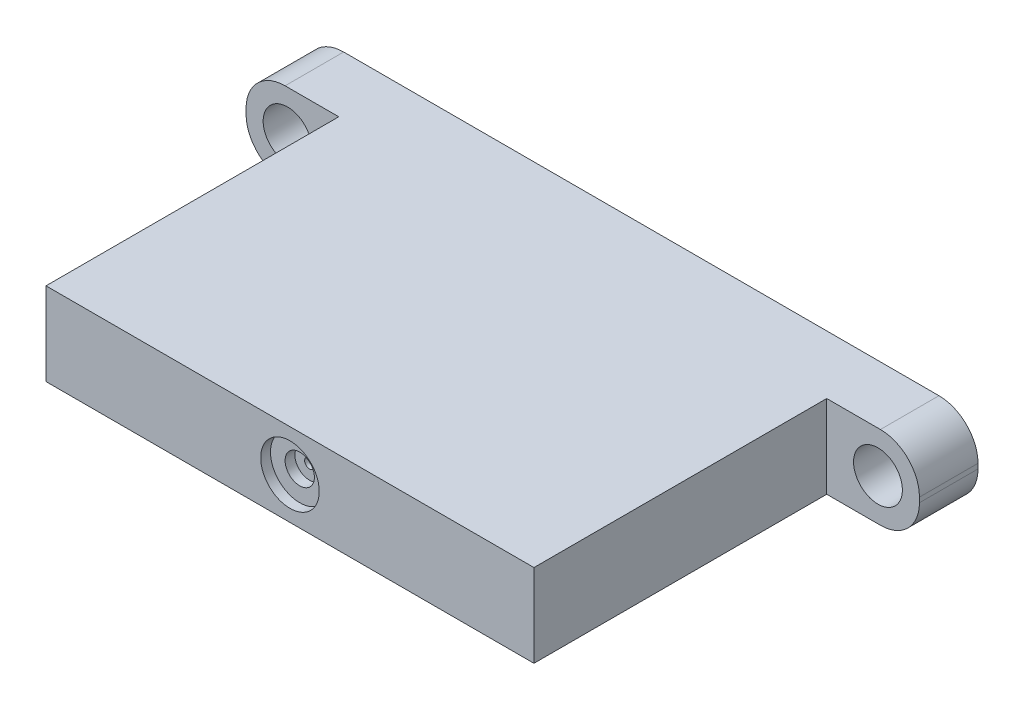
ISO-10303-21;
HEADER;
FILE_DESCRIPTION(('STEP AP214'),'2;1');
FILE_NAME('part.step','',(''),(''),'','','');
FILE_SCHEMA(('AUTOMOTIVE_DESIGN { 1 0 10303 214 1 1 1 1 }'));
ENDSEC;
DATA;
#1=APPLICATION_CONTEXT('core data for automotive mechanical design processes');
#2=APPLICATION_PROTOCOL_DEFINITION('international standard','automotive_design',2000,#1);
#3=PRODUCT_CONTEXT('',#1,'mechanical');
#4=PRODUCT('Part','Part','',(#3));
#5=PRODUCT_RELATED_PRODUCT_CATEGORY('part','',(#4));
#6=PRODUCT_DEFINITION_FORMATION('','',#4);
#7=PRODUCT_DEFINITION_CONTEXT('part definition',#1,'design');
#8=PRODUCT_DEFINITION('design','',#6,#7);
#9=PRODUCT_DEFINITION_SHAPE('','',#8);
#10=(LENGTH_UNIT() NAMED_UNIT(*) SI_UNIT(.MILLI.,.METRE.));
#11=(NAMED_UNIT(*) PLANE_ANGLE_UNIT() SI_UNIT($,.RADIAN.));
#12=(NAMED_UNIT(*) SI_UNIT($,.STERADIAN.) SOLID_ANGLE_UNIT());
#13=UNCERTAINTY_MEASURE_WITH_UNIT(LENGTH_MEASURE(1.E-05),#10,'distance_accuracy_value','');
#14=(GEOMETRIC_REPRESENTATION_CONTEXT(3) GLOBAL_UNCERTAINTY_ASSIGNED_CONTEXT((#13)) GLOBAL_UNIT_ASSIGNED_CONTEXT((#10,
#11,#12)) REPRESENTATION_CONTEXT('',''));
#15=CARTESIAN_POINT('',(0.,0.,0.));
#16=DIRECTION('',(0.,0.,1.));
#17=DIRECTION('',(1.,0.,0.));
#18=AXIS2_PLACEMENT_3D('',#15,#16,#17);
#19=CARTESIAN_POINT('',(0.,0.,6.));
#20=DIRECTION('',(0.,0.,1.));
#21=DIRECTION('',(1.,0.,0.));
#22=AXIS2_PLACEMENT_3D('',#19,#20,#21);
#23=PLANE('',#22);
#24=CARTESIAN_POINT('',(-30.25,0.,6.));
#25=DIRECTION('',(0.,0.,1.));
#26=DIRECTION('',(1.,0.,0.));
#27=AXIS2_PLACEMENT_3D('',#24,#25,#26);
#28=CIRCLE('',#27,2.5);
#29=CARTESIAN_POINT('',(-27.75,0.,6.));
#30=VERTEX_POINT('',#29);
#31=EDGE_CURVE('E241',#30,#30,#28,.T.);
#32=ORIENTED_EDGE('',*,*,#31,.F.);
#33=EDGE_LOOP('',(#32));
#34=FACE_BOUND('',#33,.T.);
#35=DIRECTION('',(0.,-1.,0.));
#36=VECTOR('',#35,1.);
#37=CARTESIAN_POINT('',(-34.5,-4.25,6.));
#38=LINE('',#37,#36);
#39=CARTESIAN_POINT('',(-34.5,0.249999999999997,6.));
#40=VERTEX_POINT('',#39);
#41=CARTESIAN_POINT('',(-34.5,-0.250000000000004,6.));
#42=VERTEX_POINT('',#41);
#43=EDGE_CURVE('E158',#40,#42,#38,.T.);
#44=ORIENTED_EDGE('',*,*,#43,.T.);
#45=CARTESIAN_POINT('',(-30.5,-0.250000000000003,6.));
#46=DIRECTION('',(0.,0.,1.));
#47=DIRECTION('',(1.,0.,0.));
#48=AXIS2_PLACEMENT_3D('',#45,#46,#47);
#49=CIRCLE('',#48,4.);
#50=CARTESIAN_POINT('',(-30.5,-4.25,6.));
#51=VERTEX_POINT('',#50);
#52=EDGE_CURVE('E11',#42,#51,#49,.T.);
#53=ORIENTED_EDGE('',*,*,#52,.T.);
#54=DIRECTION('',(1.,0.,0.));
#55=VECTOR('',#54,1.);
#56=CARTESIAN_POINT('',(34.5,-4.25,6.));
#57=LINE('',#56,#55);
#58=CARTESIAN_POINT('',(-25.,-4.25,6.));
#59=VERTEX_POINT('',#58);
#60=EDGE_CURVE('E162',#51,#59,#57,.T.);
#61=ORIENTED_EDGE('',*,*,#60,.T.);
#62=DIRECTION('',(0.,-1.,0.));
#63=VECTOR('',#62,1.);
#64=CARTESIAN_POINT('',(-25.,-4.25,6.));
#65=LINE('',#64,#63);
#66=CARTESIAN_POINT('',(-25.,4.25,6.));
#67=VERTEX_POINT('',#66);
#68=EDGE_CURVE('E149',#67,#59,#65,.T.);
#69=ORIENTED_EDGE('',*,*,#68,.F.);
#70=DIRECTION('',(-1.,0.,0.));
#71=VECTOR('',#70,1.);
#72=CARTESIAN_POINT('',(34.5,4.25,6.));
#73=LINE('',#72,#71);
#74=CARTESIAN_POINT('',(-30.5,4.25,6.));
#75=VERTEX_POINT('',#74);
#76=EDGE_CURVE('E167',#67,#75,#73,.T.);
#77=ORIENTED_EDGE('',*,*,#76,.T.);
#78=CARTESIAN_POINT('',(-30.5,0.249999999999997,6.));
#79=DIRECTION('',(0.,0.,1.));
#80=DIRECTION('',(1.,0.,0.));
#81=AXIS2_PLACEMENT_3D('',#78,#79,#80);
#82=CIRCLE('',#81,4.);
#83=EDGE_CURVE('E42',#75,#40,#82,.T.);
#84=ORIENTED_EDGE('',*,*,#83,.T.);
#85=EDGE_LOOP('',(#44,#53,#61,#69,#77,#84));
#86=FACE_BOUND('',#85,.T.);
#87=ADVANCED_FACE('F34',(#34,#86),#23,.T.);
#88=CARTESIAN_POINT('',(-34.5,-4.25,6.));
#89=DIRECTION('',(1.,0.,0.));
#90=DIRECTION('',(0.,0.,-1.));
#91=AXIS2_PLACEMENT_3D('',#88,#89,#90);
#92=PLANE('',#91);
#93=DIRECTION('',(0.,-1.,0.));
#94=VECTOR('',#93,1.);
#95=CARTESIAN_POINT('',(-34.5,-4.25,0.));
#96=LINE('',#95,#94);
#97=CARTESIAN_POINT('',(-34.5,0.249999999999997,0.));
#98=VERTEX_POINT('',#97);
#99=CARTESIAN_POINT('',(-34.5,-0.250000000000004,0.));
#100=VERTEX_POINT('',#99);
#101=EDGE_CURVE('E150',#98,#100,#96,.T.);
#102=ORIENTED_EDGE('',*,*,#101,.T.);
#103=DIRECTION('',(0.,0.,-1.));
#104=VECTOR('',#103,1.);
#105=CARTESIAN_POINT('',(-34.5,-0.250000000000004,6.));
#106=LINE('',#105,#104);
#107=EDGE_CURVE('E49',#100,#42,#106,.F.);
#108=ORIENTED_EDGE('',*,*,#107,.T.);
#109=ORIENTED_EDGE('',*,*,#43,.F.);
#110=DIRECTION('',(0.,0.,-1.));
#111=VECTOR('',#110,1.);
#112=CARTESIAN_POINT('',(-34.5,0.249999999999997,6.));
#113=LINE('',#112,#111);
#114=EDGE_CURVE('E203',#40,#98,#113,.T.);
#115=ORIENTED_EDGE('',*,*,#114,.T.);
#116=EDGE_LOOP('',(#102,#108,#109,#115));
#117=FACE_BOUND('',#116,.T.);
#118=ADVANCED_FACE('F208',(#117),#92,.F.);
#119=CARTESIAN_POINT('',(34.5,-4.25,6.));
#120=DIRECTION('',(0.,1.,0.));
#121=DIRECTION('',(-1.,0.,0.));
#122=AXIS2_PLACEMENT_3D('',#119,#120,#121);
#123=PLANE('',#122);
#124=DIRECTION('',(1.,0.,0.));
#125=VECTOR('',#124,1.);
#126=CARTESIAN_POINT('',(34.5,-4.25,0.));
#127=LINE('',#126,#125);
#128=CARTESIAN_POINT('',(-30.5,-4.25,0.));
#129=VERTEX_POINT('',#128);
#130=CARTESIAN_POINT('',(30.5,-4.25,0.));
#131=VERTEX_POINT('',#130);
#132=EDGE_CURVE('E152',#129,#131,#127,.T.);
#133=ORIENTED_EDGE('',*,*,#132,.T.);
#134=DIRECTION('',(0.,0.,-1.));
#135=VECTOR('',#134,1.);
#136=CARTESIAN_POINT('',(30.5,-4.25,6.));
#137=LINE('',#136,#135);
#138=CARTESIAN_POINT('',(30.5,-4.25,6.));
#139=VERTEX_POINT('',#138);
#140=EDGE_CURVE('E201',#131,#139,#137,.F.);
#141=ORIENTED_EDGE('',*,*,#140,.T.);
#142=CARTESIAN_POINT('',(25.,-4.25,6.));
#143=VERTEX_POINT('',#142);
#144=EDGE_CURVE('E160',#143,#139,#57,.T.);
#145=ORIENTED_EDGE('',*,*,#144,.F.);
#146=DIRECTION('',(0.,0.,-1.));
#147=VECTOR('',#146,1.);
#148=CARTESIAN_POINT('',(25.,-4.25,36.));
#149=LINE('',#148,#147);
#150=CARTESIAN_POINT('',(25.,-4.25,36.));
#151=VERTEX_POINT('',#150);
#152=EDGE_CURVE('E133',#151,#143,#149,.T.);
#153=ORIENTED_EDGE('',*,*,#152,.F.);
#154=DIRECTION('',(1.,0.,0.));
#155=VECTOR('',#154,1.);
#156=CARTESIAN_POINT('',(25.,-4.25,36.));
#157=LINE('',#156,#155);
#158=CARTESIAN_POINT('',(-25.,-4.25,36.));
#159=VERTEX_POINT('',#158);
#160=EDGE_CURVE('E123',#159,#151,#157,.T.);
#161=ORIENTED_EDGE('',*,*,#160,.F.);
#162=DIRECTION('',(0.,0.,-1.));
#163=VECTOR('',#162,1.);
#164=CARTESIAN_POINT('',(-25.,-4.25,36.));
#165=LINE('',#164,#163);
#166=EDGE_CURVE('E129',#159,#59,#165,.T.);
#167=ORIENTED_EDGE('',*,*,#166,.T.);
#168=ORIENTED_EDGE('',*,*,#60,.F.);
#169=DIRECTION('',(0.,0.,-1.));
#170=VECTOR('',#169,1.);
#171=CARTESIAN_POINT('',(-30.5,-4.25,6.));
#172=LINE('',#171,#170);
#173=EDGE_CURVE('E198',#51,#129,#172,.T.);
#174=ORIENTED_EDGE('',*,*,#173,.T.);
#175=EDGE_LOOP('',(#133,#141,#145,#153,#161,#167,#168,#174));
#176=FACE_BOUND('',#175,.T.);
#177=ADVANCED_FACE('F126',(#176),#123,.F.);
#178=CARTESIAN_POINT('',(34.5,-4.25,6.));
#179=DIRECTION('',(-1.,0.,0.));
#180=DIRECTION('',(0.,0.,1.));
#181=AXIS2_PLACEMENT_3D('',#178,#179,#180);
#182=PLANE('',#181);
#183=DIRECTION('',(0.,1.,0.));
#184=VECTOR('',#183,1.);
#185=CARTESIAN_POINT('',(34.5,-4.25,0.));
#186=LINE('',#185,#184);
#187=CARTESIAN_POINT('',(34.5,-0.249999999999998,0.));
#188=VERTEX_POINT('',#187);
#189=CARTESIAN_POINT('',(34.5,0.250000000000004,0.));
#190=VERTEX_POINT('',#189);
#191=EDGE_CURVE('E172',#188,#190,#186,.T.);
#192=ORIENTED_EDGE('',*,*,#191,.T.);
#193=DIRECTION('',(0.,0.,-1.));
#194=VECTOR('',#193,1.);
#195=CARTESIAN_POINT('',(34.5,0.250000000000004,6.));
#196=LINE('',#195,#194);
#197=CARTESIAN_POINT('',(34.5,0.250000000000004,6.));
#198=VERTEX_POINT('',#197);
#199=EDGE_CURVE('E192',#190,#198,#196,.F.);
#200=ORIENTED_EDGE('',*,*,#199,.T.);
#201=DIRECTION('',(0.,1.,0.));
#202=VECTOR('',#201,1.);
#203=CARTESIAN_POINT('',(34.5,-4.25,6.));
#204=LINE('',#203,#202);
#205=CARTESIAN_POINT('',(34.5,-0.249999999999998,6.));
#206=VERTEX_POINT('',#205);
#207=EDGE_CURVE('E164',#206,#198,#204,.T.);
#208=ORIENTED_EDGE('',*,*,#207,.F.);
#209=DIRECTION('',(0.,0.,-1.));
#210=VECTOR('',#209,1.);
#211=CARTESIAN_POINT('',(34.5,-0.249999999999998,6.));
#212=LINE('',#211,#210);
#213=EDGE_CURVE('E189',#206,#188,#212,.T.);
#214=ORIENTED_EDGE('',*,*,#213,.T.);
#215=EDGE_LOOP('',(#192,#200,#208,#214));
#216=FACE_BOUND('',#215,.T.);
#217=ADVANCED_FACE('F327',(#216),#182,.F.);
#218=CARTESIAN_POINT('',(34.5,4.25,6.));
#219=DIRECTION('',(0.,-1.,0.));
#220=DIRECTION('',(1.,0.,0.));
#221=AXIS2_PLACEMENT_3D('',#218,#219,#220);
#222=PLANE('',#221);
#223=CARTESIAN_POINT('',(30.5,4.25,6.));
#224=VERTEX_POINT('',#223);
#225=CARTESIAN_POINT('',(25.,4.25,6.));
#226=VERTEX_POINT('',#225);
#227=EDGE_CURVE('E168',#224,#226,#73,.T.);
#228=ORIENTED_EDGE('',*,*,#227,.F.);
#229=DIRECTION('',(0.,0.,-1.));
#230=VECTOR('',#229,1.);
#231=CARTESIAN_POINT('',(30.5,4.25,6.));
#232=LINE('',#231,#230);
#233=CARTESIAN_POINT('',(30.5,4.25,0.));
#234=VERTEX_POINT('',#233);
#235=EDGE_CURVE('E178',#224,#234,#232,.T.);
#236=ORIENTED_EDGE('',*,*,#235,.T.);
#237=DIRECTION('',(-1.,0.,0.));
#238=VECTOR('',#237,1.);
#239=CARTESIAN_POINT('',(34.5,4.25,0.));
#240=LINE('',#239,#238);
#241=CARTESIAN_POINT('',(-30.5,4.25,0.));
#242=VERTEX_POINT('',#241);
#243=EDGE_CURVE('E161',#234,#242,#240,.T.);
#244=ORIENTED_EDGE('',*,*,#243,.T.);
#245=DIRECTION('',(0.,0.,-1.));
#246=VECTOR('',#245,1.);
#247=CARTESIAN_POINT('',(-30.5,4.25,6.));
#248=LINE('',#247,#246);
#249=EDGE_CURVE('E169',#242,#75,#248,.F.);
#250=ORIENTED_EDGE('',*,*,#249,.T.);
#251=ORIENTED_EDGE('',*,*,#76,.F.);
#252=DIRECTION('',(0.,0.,-1.));
#253=VECTOR('',#252,1.);
#254=CARTESIAN_POINT('',(-25.,4.25,36.));
#255=LINE('',#254,#253);
#256=CARTESIAN_POINT('',(-25.,4.25,36.));
#257=VERTEX_POINT('',#256);
#258=EDGE_CURVE('E225',#257,#67,#255,.T.);
#259=ORIENTED_EDGE('',*,*,#258,.F.);
#260=DIRECTION('',(-1.,0.,0.));
#261=VECTOR('',#260,1.);
#262=CARTESIAN_POINT('',(25.,4.25,36.));
#263=LINE('',#262,#261);
#264=CARTESIAN_POINT('',(25.,4.25,36.));
#265=VERTEX_POINT('',#264);
#266=EDGE_CURVE('E142',#265,#257,#263,.T.);
#267=ORIENTED_EDGE('',*,*,#266,.F.);
#268=DIRECTION('',(0.,0.,-1.));
#269=VECTOR('',#268,1.);
#270=CARTESIAN_POINT('',(25.,4.25,36.));
#271=LINE('',#270,#269);
#272=EDGE_CURVE('E154',#265,#226,#271,.T.);
#273=ORIENTED_EDGE('',*,*,#272,.T.);
#274=EDGE_LOOP('',(#228,#236,#244,#250,#251,#259,#267,#273));
#275=FACE_BOUND('',#274,.T.);
#276=ADVANCED_FACE('F224',(#275),#222,.F.);
#277=CARTESIAN_POINT('',(30.25,0.,6.));
#278=DIRECTION('',(0.,0.,1.));
#279=DIRECTION('',(-1.,0.,0.));
#280=AXIS2_PLACEMENT_3D('',#277,#278,#279);
#281=CIRCLE('',#280,2.5);
#282=CARTESIAN_POINT('',(27.75,0.,6.));
#283=VERTEX_POINT('',#282);
#284=EDGE_CURVE('E234',#283,#283,#281,.T.);
#285=ORIENTED_EDGE('',*,*,#284,.F.);
#286=EDGE_LOOP('',(#285));
#287=FACE_BOUND('',#286,.T.);
#288=ORIENTED_EDGE('',*,*,#207,.T.);
#289=CARTESIAN_POINT('',(30.5,0.250000000000003,6.));
#290=DIRECTION('',(0.,0.,1.));
#291=DIRECTION('',(1.,0.,0.));
#292=AXIS2_PLACEMENT_3D('',#289,#290,#291);
#293=CIRCLE('',#292,4.);
#294=EDGE_CURVE('E196',#198,#224,#293,.T.);
#295=ORIENTED_EDGE('',*,*,#294,.T.);
#296=ORIENTED_EDGE('',*,*,#227,.T.);
#297=DIRECTION('',(0.,1.,0.));
#298=VECTOR('',#297,1.);
#299=CARTESIAN_POINT('',(25.,-4.25,6.));
#300=LINE('',#299,#298);
#301=EDGE_CURVE('E146',#143,#226,#300,.T.);
#302=ORIENTED_EDGE('',*,*,#301,.F.);
#303=ORIENTED_EDGE('',*,*,#144,.T.);
#304=CARTESIAN_POINT('',(30.5,-0.249999999999998,6.));
#305=DIRECTION('',(0.,0.,1.));
#306=DIRECTION('',(1.,0.,0.));
#307=AXIS2_PLACEMENT_3D('',#304,#305,#306);
#308=CIRCLE('',#307,4.);
#309=EDGE_CURVE('E194',#139,#206,#308,.T.);
#310=ORIENTED_EDGE('',*,*,#309,.T.);
#311=EDGE_LOOP('',(#288,#295,#296,#302,#303,#310));
#312=FACE_BOUND('',#311,.T.);
#313=ADVANCED_FACE('F312',(#287,#312),#23,.T.);
#314=CARTESIAN_POINT('',(0.,0.,0.));
#315=DIRECTION('',(0.,0.,1.));
#316=DIRECTION('',(1.,0.,0.));
#317=AXIS2_PLACEMENT_3D('',#314,#315,#316);
#318=PLANE('',#317);
#319=CARTESIAN_POINT('',(-30.25,0.,0.));
#320=DIRECTION('',(0.,0.,1.));
#321=DIRECTION('',(1.,0.,0.));
#322=AXIS2_PLACEMENT_3D('',#319,#320,#321);
#323=CIRCLE('',#322,2.5);
#324=CARTESIAN_POINT('',(-27.75,0.,0.));
#325=VERTEX_POINT('',#324);
#326=EDGE_CURVE('E220',#325,#325,#323,.T.);
#327=ORIENTED_EDGE('',*,*,#326,.T.);
#328=EDGE_LOOP('',(#327));
#329=FACE_BOUND('',#328,.T.);
#330=CARTESIAN_POINT('',(30.25,0.,0.));
#331=DIRECTION('',(0.,0.,1.));
#332=DIRECTION('',(-1.,0.,0.));
#333=AXIS2_PLACEMENT_3D('',#330,#331,#332);
#334=CIRCLE('',#333,2.5);
#335=CARTESIAN_POINT('',(27.75,0.,0.));
#336=VERTEX_POINT('',#335);
#337=EDGE_CURVE('E237',#336,#336,#334,.T.);
#338=ORIENTED_EDGE('',*,*,#337,.T.);
#339=EDGE_LOOP('',(#338));
#340=FACE_BOUND('',#339,.T.);
#341=ORIENTED_EDGE('',*,*,#243,.F.);
#342=CARTESIAN_POINT('',(30.5,0.250000000000003,0.));
#343=DIRECTION('',(0.,0.,1.));
#344=DIRECTION('',(1.,0.,0.));
#345=AXIS2_PLACEMENT_3D('',#342,#343,#344);
#346=CIRCLE('',#345,4.);
#347=EDGE_CURVE('E187',#234,#190,#346,.F.);
#348=ORIENTED_EDGE('',*,*,#347,.T.);
#349=ORIENTED_EDGE('',*,*,#191,.F.);
#350=CARTESIAN_POINT('',(30.5,-0.249999999999998,0.));
#351=DIRECTION('',(0.,0.,1.));
#352=DIRECTION('',(1.,0.,0.));
#353=AXIS2_PLACEMENT_3D('',#350,#351,#352);
#354=CIRCLE('',#353,4.);
#355=EDGE_CURVE('E185',#188,#131,#354,.F.);
#356=ORIENTED_EDGE('',*,*,#355,.T.);
#357=ORIENTED_EDGE('',*,*,#132,.F.);
#358=CARTESIAN_POINT('',(-30.5,-0.250000000000003,0.));
#359=DIRECTION('',(0.,0.,1.));
#360=DIRECTION('',(1.,0.,0.));
#361=AXIS2_PLACEMENT_3D('',#358,#359,#360);
#362=CIRCLE('',#361,4.);
#363=EDGE_CURVE('E183',#129,#100,#362,.F.);
#364=ORIENTED_EDGE('',*,*,#363,.T.);
#365=ORIENTED_EDGE('',*,*,#101,.F.);
#366=CARTESIAN_POINT('',(-30.5,0.249999999999997,0.));
#367=DIRECTION('',(0.,0.,1.));
#368=DIRECTION('',(1.,0.,0.));
#369=AXIS2_PLACEMENT_3D('',#366,#367,#368);
#370=CIRCLE('',#369,4.);
#371=EDGE_CURVE('E181',#98,#242,#370,.F.);
#372=ORIENTED_EDGE('',*,*,#371,.T.);
#373=EDGE_LOOP('',(#341,#348,#349,#356,#357,#364,#365,#372));
#374=FACE_BOUND('',#373,.T.);
#375=ADVANCED_FACE('F212',(#329,#340,#374),#318,.F.);
#376=CARTESIAN_POINT('',(-25.,-4.25,36.));
#377=DIRECTION('',(1.,0.,0.));
#378=DIRECTION('',(0.,0.,-1.));
#379=AXIS2_PLACEMENT_3D('',#376,#377,#378);
#380=PLANE('',#379);
#381=ORIENTED_EDGE('',*,*,#68,.T.);
#382=ORIENTED_EDGE('',*,*,#166,.F.);
#383=DIRECTION('',(0.,-1.,0.));
#384=VECTOR('',#383,1.);
#385=CARTESIAN_POINT('',(-25.,-4.25,36.));
#386=LINE('',#385,#384);
#387=EDGE_CURVE('E137',#257,#159,#386,.T.);
#388=ORIENTED_EDGE('',*,*,#387,.F.);
#389=ORIENTED_EDGE('',*,*,#258,.T.);
#390=EDGE_LOOP('',(#381,#382,#388,#389));
#391=FACE_BOUND('',#390,.T.);
#392=ADVANCED_FACE('F148',(#391),#380,.F.);
#393=CARTESIAN_POINT('',(25.,-4.25,36.));
#394=DIRECTION('',(-1.,0.,0.));
#395=DIRECTION('',(0.,0.,1.));
#396=AXIS2_PLACEMENT_3D('',#393,#394,#395);
#397=PLANE('',#396);
#398=ORIENTED_EDGE('',*,*,#301,.T.);
#399=ORIENTED_EDGE('',*,*,#272,.F.);
#400=DIRECTION('',(0.,1.,0.));
#401=VECTOR('',#400,1.);
#402=CARTESIAN_POINT('',(25.,-4.25,36.));
#403=LINE('',#402,#401);
#404=EDGE_CURVE('E136',#151,#265,#403,.T.);
#405=ORIENTED_EDGE('',*,*,#404,.F.);
#406=ORIENTED_EDGE('',*,*,#152,.T.);
#407=EDGE_LOOP('',(#398,#399,#405,#406));
#408=FACE_BOUND('',#407,.T.);
#409=ADVANCED_FACE('F298',(#408),#397,.F.);
#410=CARTESIAN_POINT('',(0.,0.,36.));
#411=DIRECTION('',(0.,0.,1.));
#412=DIRECTION('',(1.,0.,0.));
#413=AXIS2_PLACEMENT_3D('',#410,#411,#412);
#414=PLANE('',#413);
#415=CARTESIAN_POINT('',(0.,0.,36.));
#416=DIRECTION('',(0.,0.,1.));
#417=DIRECTION('',(1.,0.,0.));
#418=AXIS2_PLACEMENT_3D('',#415,#416,#417);
#419=CIRCLE('',#418,3.);
#420=CARTESIAN_POINT('',(3.,0.,36.));
#421=VERTEX_POINT('',#420);
#422=EDGE_CURVE('E246',#421,#421,#419,.T.);
#423=ORIENTED_EDGE('',*,*,#422,.F.);
#424=EDGE_LOOP('',(#423));
#425=FACE_BOUND('',#424,.T.);
#426=ORIENTED_EDGE('',*,*,#387,.T.);
#427=ORIENTED_EDGE('',*,*,#160,.T.);
#428=ORIENTED_EDGE('',*,*,#404,.T.);
#429=ORIENTED_EDGE('',*,*,#266,.T.);
#430=EDGE_LOOP('',(#426,#427,#428,#429));
#431=FACE_BOUND('',#430,.T.);
#432=ADVANCED_FACE('F140',(#425,#431),#414,.T.);
#433=CARTESIAN_POINT('',(30.25,0.,0.));
#434=DIRECTION('',(0.,0.,1.));
#435=DIRECTION('',(1.,0.,0.));
#436=AXIS2_PLACEMENT_3D('',#433,#434,#435);
#437=CYLINDRICAL_SURFACE('',#436,2.5);
#438=ORIENTED_EDGE('',*,*,#337,.F.);
#439=EDGE_LOOP('',(#438));
#440=FACE_BOUND('',#439,.T.);
#441=ORIENTED_EDGE('',*,*,#284,.T.);
#442=EDGE_LOOP('',(#441));
#443=FACE_BOUND('',#442,.T.);
#444=ADVANCED_FACE('F297',(#440,#443),#437,.F.);
#445=CARTESIAN_POINT('',(-30.25,0.,0.));
#446=DIRECTION('',(0.,0.,1.));
#447=DIRECTION('',(1.,0.,0.));
#448=AXIS2_PLACEMENT_3D('',#445,#446,#447);
#449=CYLINDRICAL_SURFACE('',#448,2.5);
#450=ORIENTED_EDGE('',*,*,#326,.F.);
#451=EDGE_LOOP('',(#450));
#452=FACE_BOUND('',#451,.T.);
#453=ORIENTED_EDGE('',*,*,#31,.T.);
#454=EDGE_LOOP('',(#453));
#455=FACE_BOUND('',#454,.T.);
#456=ADVANCED_FACE('F304',(#452,#455),#449,.F.);
#457=CARTESIAN_POINT('',(30.5,0.250000000000003,6.));
#458=DIRECTION('',(0.,0.,-1.));
#459=DIRECTION('',(-1.,0.,0.));
#460=AXIS2_PLACEMENT_3D('',#457,#458,#459);
#461=CYLINDRICAL_SURFACE('',#460,4.);
#462=ORIENTED_EDGE('',*,*,#294,.F.);
#463=ORIENTED_EDGE('',*,*,#199,.F.);
#464=ORIENTED_EDGE('',*,*,#347,.F.);
#465=ORIENTED_EDGE('',*,*,#235,.F.);
#466=EDGE_LOOP('',(#462,#463,#464,#465));
#467=FACE_BOUND('',#466,.T.);
#468=ADVANCED_FACE('F340',(#467),#461,.T.);
#469=CARTESIAN_POINT('',(30.5,-0.249999999999998,6.));
#470=DIRECTION('',(0.,0.,-1.));
#471=DIRECTION('',(-1.,0.,0.));
#472=AXIS2_PLACEMENT_3D('',#469,#470,#471);
#473=CYLINDRICAL_SURFACE('',#472,4.);
#474=ORIENTED_EDGE('',*,*,#309,.F.);
#475=ORIENTED_EDGE('',*,*,#140,.F.);
#476=ORIENTED_EDGE('',*,*,#355,.F.);
#477=ORIENTED_EDGE('',*,*,#213,.F.);
#478=EDGE_LOOP('',(#474,#475,#476,#477));
#479=FACE_BOUND('',#478,.T.);
#480=ADVANCED_FACE('F343',(#479),#473,.T.);
#481=CARTESIAN_POINT('',(-30.5,-0.250000000000003,6.));
#482=DIRECTION('',(0.,0.,-1.));
#483=DIRECTION('',(-1.,0.,0.));
#484=AXIS2_PLACEMENT_3D('',#481,#482,#483);
#485=CYLINDRICAL_SURFACE('',#484,4.);
#486=ORIENTED_EDGE('',*,*,#52,.F.);
#487=ORIENTED_EDGE('',*,*,#107,.F.);
#488=ORIENTED_EDGE('',*,*,#363,.F.);
#489=ORIENTED_EDGE('',*,*,#173,.F.);
#490=EDGE_LOOP('',(#486,#487,#488,#489));
#491=FACE_BOUND('',#490,.T.);
#492=ADVANCED_FACE('F217',(#491),#485,.T.);
#493=CARTESIAN_POINT('',(-30.5,0.249999999999997,6.));
#494=DIRECTION('',(0.,0.,-1.));
#495=DIRECTION('',(-1.,0.,0.));
#496=AXIS2_PLACEMENT_3D('',#493,#494,#495);
#497=CYLINDRICAL_SURFACE('',#496,4.);
#498=ORIENTED_EDGE('',*,*,#83,.F.);
#499=ORIENTED_EDGE('',*,*,#249,.F.);
#500=ORIENTED_EDGE('',*,*,#371,.F.);
#501=ORIENTED_EDGE('',*,*,#114,.F.);
#502=EDGE_LOOP('',(#498,#499,#500,#501));
#503=FACE_BOUND('',#502,.T.);
#504=ADVANCED_FACE('F36',(#503),#497,.T.);
#505=CARTESIAN_POINT('',(0.,0.,35.));
#506=DIRECTION('',(0.,0.,1.));
#507=DIRECTION('',(1.,0.,0.));
#508=AXIS2_PLACEMENT_3D('',#505,#506,#507);
#509=CYLINDRICAL_SURFACE('',#508,3.);
#510=CARTESIAN_POINT('',(0.,0.,35.));
#511=DIRECTION('',(0.,0.,1.));
#512=DIRECTION('',(1.,0.,0.));
#513=AXIS2_PLACEMENT_3D('',#510,#511,#512);
#514=CIRCLE('',#513,3.);
#515=CARTESIAN_POINT('',(3.,0.,35.));
#516=VERTEX_POINT('',#515);
#517=EDGE_CURVE('E238',#516,#516,#514,.T.);
#518=ORIENTED_EDGE('',*,*,#517,.F.);
#519=EDGE_LOOP('',(#518));
#520=FACE_BOUND('',#519,.T.);
#521=ORIENTED_EDGE('',*,*,#422,.T.);
#522=EDGE_LOOP('',(#521));
#523=FACE_BOUND('',#522,.T.);
#524=ADVANCED_FACE('F287',(#520,#523),#509,.F.);
#525=CARTESIAN_POINT('',(0.,0.,35.));
#526=DIRECTION('',(0.,0.,1.));
#527=DIRECTION('',(1.,0.,0.));
#528=AXIS2_PLACEMENT_3D('',#525,#526,#527);
#529=PLANE('',#528);
#530=CARTESIAN_POINT('',(0.,0.,35.));
#531=DIRECTION('',(0.,0.,1.));
#532=DIRECTION('',(1.,0.,0.));
#533=AXIS2_PLACEMENT_3D('',#530,#531,#532);
#534=CIRCLE('',#533,1.5);
#535=CARTESIAN_POINT('',(1.5,0.,35.));
#536=VERTEX_POINT('',#535);
#537=EDGE_CURVE('E252',#536,#536,#534,.T.);
#538=ORIENTED_EDGE('',*,*,#537,.F.);
#539=EDGE_LOOP('',(#538));
#540=FACE_BOUND('',#539,.T.);
#541=ORIENTED_EDGE('',*,*,#517,.T.);
#542=EDGE_LOOP('',(#541));
#543=FACE_BOUND('',#542,.T.);
#544=ADVANCED_FACE('F281',(#540,#543),#529,.T.);
#545=CARTESIAN_POINT('',(0.,0.,34.));
#546=DIRECTION('',(0.,0.,1.));
#547=DIRECTION('',(1.,0.,0.));
#548=AXIS2_PLACEMENT_3D('',#545,#546,#547);
#549=CYLINDRICAL_SURFACE('',#548,1.5);
#550=CARTESIAN_POINT('',(0.,0.,34.));
#551=DIRECTION('',(0.,0.,1.));
#552=DIRECTION('',(1.,0.,0.));
#553=AXIS2_PLACEMENT_3D('',#550,#551,#552);
#554=CIRCLE('',#553,1.5);
#555=CARTESIAN_POINT('',(1.5,0.,34.));
#556=VERTEX_POINT('',#555);
#557=EDGE_CURVE('E249',#556,#556,#554,.T.);
#558=ORIENTED_EDGE('',*,*,#557,.F.);
#559=EDGE_LOOP('',(#558));
#560=FACE_BOUND('',#559,.T.);
#561=ORIENTED_EDGE('',*,*,#537,.T.);
#562=EDGE_LOOP('',(#561));
#563=FACE_BOUND('',#562,.T.);
#564=ADVANCED_FACE('F275',(#560,#563),#549,.F.);
#565=CARTESIAN_POINT('',(0.,0.,34.));
#566=DIRECTION('',(0.,0.,1.));
#567=DIRECTION('',(1.,0.,0.));
#568=AXIS2_PLACEMENT_3D('',#565,#566,#567);
#569=PLANE('',#568);
#570=CARTESIAN_POINT('',(0.,0.,34.));
#571=DIRECTION('',(0.,0.,1.));
#572=DIRECTION('',(1.,0.,0.));
#573=AXIS2_PLACEMENT_3D('',#570,#571,#572);
#574=CIRCLE('',#573,0.5);
#575=CARTESIAN_POINT('',(0.5,0.,34.));
#576=VERTEX_POINT('',#575);
#577=EDGE_CURVE('E258',#576,#576,#574,.T.);
#578=ORIENTED_EDGE('',*,*,#577,.F.);
#579=EDGE_LOOP('',(#578));
#580=FACE_BOUND('',#579,.T.);
#581=ORIENTED_EDGE('',*,*,#557,.T.);
#582=EDGE_LOOP('',(#581));
#583=FACE_BOUND('',#582,.T.);
#584=ADVANCED_FACE('F269',(#580,#583),#569,.T.);
#585=CARTESIAN_POINT('',(0.,0.,33.));
#586=DIRECTION('',(0.,0.,1.));
#587=DIRECTION('',(1.,0.,0.));
#588=AXIS2_PLACEMENT_3D('',#585,#586,#587);
#589=CYLINDRICAL_SURFACE('',#588,0.5);
#590=CARTESIAN_POINT('',(0.,0.,33.));
#591=DIRECTION('',(0.,0.,1.));
#592=DIRECTION('',(1.,0.,0.));
#593=AXIS2_PLACEMENT_3D('',#590,#591,#592);
#594=CIRCLE('',#593,0.5);
#595=CARTESIAN_POINT('',(0.5,0.,33.));
#596=VERTEX_POINT('',#595);
#597=EDGE_CURVE('E255',#596,#596,#594,.T.);
#598=ORIENTED_EDGE('',*,*,#597,.F.);
#599=EDGE_LOOP('',(#598));
#600=FACE_BOUND('',#599,.T.);
#601=ORIENTED_EDGE('',*,*,#577,.T.);
#602=EDGE_LOOP('',(#601));
#603=FACE_BOUND('',#602,.T.);
#604=ADVANCED_FACE('F266',(#600,#603),#589,.F.);
#605=CARTESIAN_POINT('',(0.,0.,33.));
#606=DIRECTION('',(0.,0.,1.));
#607=DIRECTION('',(1.,0.,0.));
#608=AXIS2_PLACEMENT_3D('',#605,#606,#607);
#609=PLANE('',#608);
#610=ORIENTED_EDGE('',*,*,#597,.T.);
#611=EDGE_LOOP('',(#610));
#612=FACE_BOUND('',#611,.T.);
#613=ADVANCED_FACE('F264',(#612),#609,.T.);
#614=CLOSED_SHELL('',(#87,#118,#177,#217,#276,#313,#375,#392,#409,#432,#444,#456,#468,#480,#492,
#504,#524,#544,#564,#584,#604,#613));
#615=MANIFOLD_SOLID_BREP('B2',#614);
#616=ADVANCED_BREP_SHAPE_REPRESENTATION('',(#18,#615),#14);
#617=SHAPE_DEFINITION_REPRESENTATION(#9,#616);
ENDSEC;
END-ISO-10303-21;
